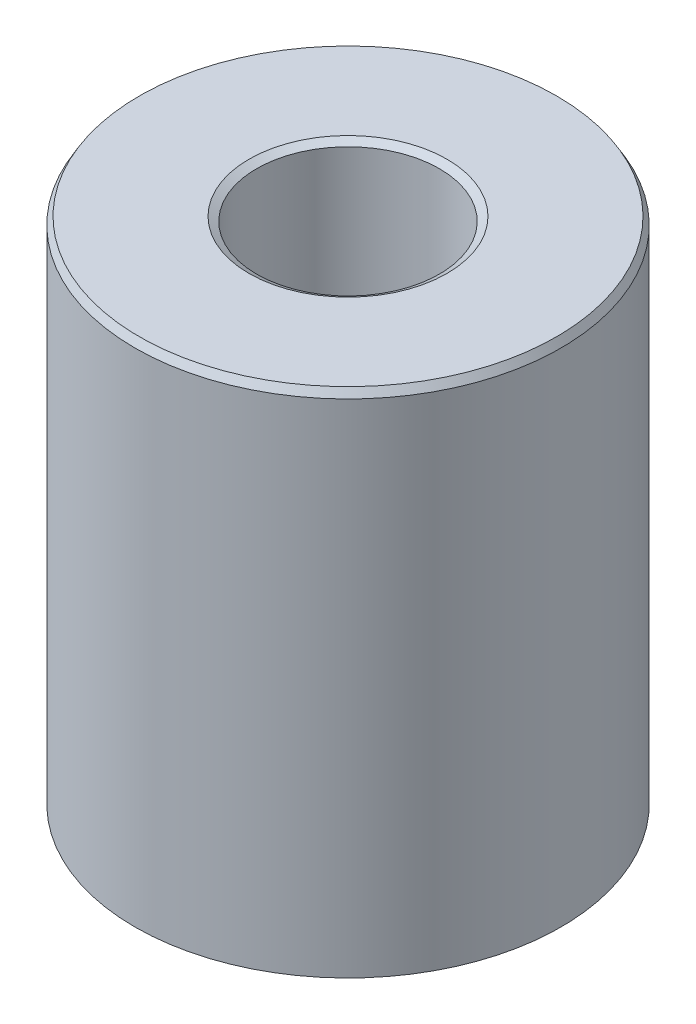
ISO-10303-21;
HEADER;
FILE_DESCRIPTION(('STEP AP214'),'2;1');
FILE_NAME('part.step','',(''),(''),'','','');
FILE_SCHEMA(('AUTOMOTIVE_DESIGN { 1 0 10303 214 1 1 1 1 }'));
ENDSEC;
DATA;
#1=APPLICATION_CONTEXT('core data for automotive mechanical design processes');
#2=APPLICATION_PROTOCOL_DEFINITION('international standard','automotive_design',2000,#1);
#3=PRODUCT_CONTEXT('',#1,'mechanical');
#4=PRODUCT('Part','Part','',(#3));
#5=PRODUCT_RELATED_PRODUCT_CATEGORY('part','',(#4));
#6=PRODUCT_DEFINITION_FORMATION('','',#4);
#7=PRODUCT_DEFINITION_CONTEXT('part definition',#1,'design');
#8=PRODUCT_DEFINITION('design','',#6,#7);
#9=PRODUCT_DEFINITION_SHAPE('','',#8);
#10=(LENGTH_UNIT() NAMED_UNIT(*) SI_UNIT(.MILLI.,.METRE.));
#11=(NAMED_UNIT(*) PLANE_ANGLE_UNIT() SI_UNIT($,.RADIAN.));
#12=(NAMED_UNIT(*) SI_UNIT($,.STERADIAN.) SOLID_ANGLE_UNIT());
#13=UNCERTAINTY_MEASURE_WITH_UNIT(LENGTH_MEASURE(1.E-05),#10,'distance_accuracy_value','');
#14=(GEOMETRIC_REPRESENTATION_CONTEXT(3) GLOBAL_UNCERTAINTY_ASSIGNED_CONTEXT((#13)) GLOBAL_UNIT_ASSIGNED_CONTEXT((#10,
#11,#12)) REPRESENTATION_CONTEXT('',''));
#15=CARTESIAN_POINT('',(0.,0.,0.));
#16=DIRECTION('',(0.,0.,1.));
#17=DIRECTION('',(1.,0.,0.));
#18=AXIS2_PLACEMENT_3D('',#15,#16,#17);
#19=CARTESIAN_POINT('',(0.,84.3690094837138,0.));
#20=DIRECTION('',(0.,-1.,0.));
#21=DIRECTION('',(0.,0.,-1.));
#22=AXIS2_PLACEMENT_3D('',#19,#20,#21);
#23=CYLINDRICAL_SURFACE('',#22,35.);
#24=CARTESIAN_POINT('',(0.,0.720286490076341,0.));
#25=DIRECTION('',(0.,1.,0.));
#26=DIRECTION('',(0.,0.,1.));
#27=AXIS2_PLACEMENT_3D('',#24,#25,#26);
#28=CIRCLE('',#27,35.);
#29=CARTESIAN_POINT('',(0.,0.720286490076327,-35.));
#30=VERTEX_POINT('',#29);
#31=EDGE_CURVE('E10',#30,#30,#28,.T.);
#32=CARTESIAN_POINT('',(0.,83.1214366868963,0.));
#33=DIRECTION('',(0.,1.,0.));
#34=DIRECTION('',(0.,0.,1.));
#35=AXIS2_PLACEMENT_3D('',#32,#33,#34);
#36=CIRCLE('',#35,35.);
#37=CARTESIAN_POINT('',(0.,83.1214366868962,-35.));
#38=VERTEX_POINT('',#37);
#39=EDGE_CURVE('E50',#38,#38,#36,.F.);
#40=CARTESIAN_POINT('',(0.,0.720286490076327,-35.));
#41=CARTESIAN_POINT('',(0.,1.57863180462653,-35.));
#42=CARTESIAN_POINT('',(0.,2.43697711917674,-35.));
#43=CARTESIAN_POINT('',(0.,4.15366774827715,-35.));
#44=CARTESIAN_POINT('',(0.,5.01201306282736,-35.));
#45=CARTESIAN_POINT('',(0.,6.72870369192778,-35.));
#46=CARTESIAN_POINT('',(0.,7.58704900647799,-35.));
#47=CARTESIAN_POINT('',(0.,9.30373963557841,-35.));
#48=CARTESIAN_POINT('',(0.,10.1620849501286,-35.));
#49=CARTESIAN_POINT('',(0.,11.878775579229,-35.));
#50=CARTESIAN_POINT('',(0.,12.7371208937792,-35.));
#51=CARTESIAN_POINT('',(0.,14.4538115228796,-35.));
#52=CARTESIAN_POINT('',(0.,15.3121568374299,-35.));
#53=CARTESIAN_POINT('',(0.,17.0288474665303,-35.));
#54=CARTESIAN_POINT('',(0.,17.8871927810805,-35.));
#55=CARTESIAN_POINT('',(0.,19.6038834101809,-35.));
#56=CARTESIAN_POINT('',(0.,20.4622287247311,-35.));
#57=CARTESIAN_POINT('',(0.,22.1789193538315,-35.));
#58=CARTESIAN_POINT('',(0.,23.0372646683817,-35.));
#59=CARTESIAN_POINT('',(0.,24.7539552974821,-35.));
#60=CARTESIAN_POINT('',(0.,25.6123006120323,-35.));
#61=CARTESIAN_POINT('',(0.,27.3289912411328,-35.));
#62=CARTESIAN_POINT('',(0.,28.187336555683,-35.));
#63=CARTESIAN_POINT('',(0.,29.9040271847834,-35.));
#64=CARTESIAN_POINT('',(0.,30.7623724993336,-35.));
#65=CARTESIAN_POINT('',(0.,32.479063128434,-35.));
#66=CARTESIAN_POINT('',(0.,33.3374084429842,-35.));
#67=CARTESIAN_POINT('',(0.,35.0540990720846,-35.));
#68=CARTESIAN_POINT('',(0.,35.9124443866348,-35.));
#69=CARTESIAN_POINT('',(0.,37.6291350157352,-35.));
#70=CARTESIAN_POINT('',(0.,38.4874803302855,-35.));
#71=CARTESIAN_POINT('',(0.,40.2041709593859,-35.));
#72=CARTESIAN_POINT('',(0.,41.0625162739361,-35.));
#73=CARTESIAN_POINT('',(0.,42.7792069030365,-35.));
#74=CARTESIAN_POINT('',(0.,43.6375522175867,-35.));
#75=CARTESIAN_POINT('',(0.,45.3542428466871,-35.));
#76=CARTESIAN_POINT('',(0.,46.2125881612373,-35.));
#77=CARTESIAN_POINT('',(0.,47.9292787903377,-35.));
#78=CARTESIAN_POINT('',(0.,48.7876241048879,-35.));
#79=CARTESIAN_POINT('',(0.,50.5043147339884,-35.));
#80=CARTESIAN_POINT('',(0.,51.3626600485386,-35.));
#81=CARTESIAN_POINT('',(0.,53.079350677639,-35.));
#82=CARTESIAN_POINT('',(0.,53.9376959921892,-35.));
#83=CARTESIAN_POINT('',(0.,55.6543866212896,-35.));
#84=CARTESIAN_POINT('',(0.,56.5127319358398,-35.));
#85=CARTESIAN_POINT('',(0.,58.2294225649402,-35.));
#86=CARTESIAN_POINT('',(0.,59.0877678794904,-35.));
#87=CARTESIAN_POINT('',(0.,60.8044585085908,-35.));
#88=CARTESIAN_POINT('',(0.,61.662803823141,-35.));
#89=CARTESIAN_POINT('',(0.,63.3794944522415,-35.));
#90=CARTESIAN_POINT('',(0.,64.2378397667917,-35.));
#91=CARTESIAN_POINT('',(0.,65.9545303958921,-35.));
#92=CARTESIAN_POINT('',(0.,66.8128757104423,-35.));
#93=CARTESIAN_POINT('',(0.,68.5295663395427,-35.));
#94=CARTESIAN_POINT('',(0.,69.3879116540929,-35.));
#95=CARTESIAN_POINT('',(0.,71.1046022831933,-35.));
#96=CARTESIAN_POINT('',(0.,71.9629475977436,-35.));
#97=CARTESIAN_POINT('',(0.,73.6796382268439,-35.));
#98=CARTESIAN_POINT('',(0.,74.5379835413942,-35.));
#99=CARTESIAN_POINT('',(0.,76.2546741704946,-35.));
#100=CARTESIAN_POINT('',(0.,77.1130194850448,-35.));
#101=CARTESIAN_POINT('',(0.,78.8297101141452,-35.));
#102=CARTESIAN_POINT('',(0.,79.6880554286954,-35.));
#103=CARTESIAN_POINT('',(0.,81.4047460577958,-35.));
#104=CARTESIAN_POINT('',(0.,82.263091372346,-35.));
#105=CARTESIAN_POINT('',(0.,83.1214366868962,-35.));
#106=B_SPLINE_CURVE_WITH_KNOTS('',3,(#40,#41,#42,#43,#44,#45,#46,#47,#48,#49,#50,#51,#52,#53,
#54,#55,#56,#57,#58,#59,#60,#61,#62,#63,#64,#65,#66,#67,#68,#69,#70,#71,#72,#73,#74,#75,#76,#77,
#78,#79,#80,#81,#82,#83,#84,#85,#86,#87,#88,#89,#90,#91,#92,#93,#94,#95,#96,#97,#98,#99,#100,
#101,#102,#103,#104,#105),.UNSPECIFIED.,.F.,.F.,(4,2,2,2,2,2,2,2,2,2,2,2,2,2,2,2,2,2,2,2,2,2,2,
2,2,2,2,2,2,2,2,2,4),(0.,2.57503594365062,5.15007188730124,7.72510783095187,10.3001437746025,
12.8751797182531,15.4502156619037,18.0252516055544,20.600287549205,23.1753234928556,
25.7503594365062,28.3253953801568,30.9004313238075,33.4754672674581,36.0505032111087,
38.6255391547593,41.20057509841,43.7756110420606,46.3506469857112,48.9256829293618,
51.5007188730124,54.0757548166631,56.6507907603137,59.2258267039643,61.8008626476149,
64.3758985912656,66.9509345349162,69.5259704785668,72.1010064222174,74.676042365868,
77.2510783095187,79.8261142531693,82.4011501968199),.UNSPECIFIED.);
#107=EDGE_CURVE('BSEAM39',#30,#38,#106,.T.);
#108=ORIENTED_EDGE('',*,*,#31,.T.);
#109=ORIENTED_EDGE('',*,*,#39,.T.);
#110=ORIENTED_EDGE('',*,*,#107,.T.);
#111=ORIENTED_EDGE('',*,*,#107,.F.);
#112=EDGE_LOOP('',(#108,#110,#109,#111));
#113=FACE_BOUND('',#112,.T.);
#114=ADVANCED_FACE('F39',(#113),#23,.T.);
#115=CARTESIAN_POINT('',(0.,84.3690094837138,0.));
#116=DIRECTION('',(0.,1.,0.));
#117=DIRECTION('',(0.,0.,1.));
#118=AXIS2_PLACEMENT_3D('',#115,#116,#117);
#119=PLANE('',#118);
#120=CARTESIAN_POINT('',(0.,84.3690094837138,0.));
#121=DIRECTION('',(0.,1.,0.));
#122=DIRECTION('',(0.,0.,1.));
#123=AXIS2_PLACEMENT_3D('',#120,#121,#122);
#124=CIRCLE('',#123,16.2672913488029);
#125=CARTESIAN_POINT('',(0.,84.3690094837138,16.2672913488029));
#126=VERTEX_POINT('',#125);
#127=EDGE_CURVE('E58',#126,#126,#124,.F.);
#128=ORIENTED_EDGE('',*,*,#127,.T.);
#129=EDGE_LOOP('',(#128));
#130=FACE_BOUND('',#129,.T.);
#131=CARTESIAN_POINT('',(0.,84.3690094837138,0.));
#132=DIRECTION('',(0.,1.,0.));
#133=DIRECTION('',(0.,0.,1.));
#134=AXIS2_PLACEMENT_3D('',#131,#132,#133);
#135=CIRCLE('',#134,34.2797135099238);
#136=CARTESIAN_POINT('',(0.,84.3690094837138,-34.2797135099238));
#137=VERTEX_POINT('',#136);
#138=EDGE_CURVE('E61',#137,#137,#135,.T.);
#139=ORIENTED_EDGE('',*,*,#138,.T.);
#140=EDGE_LOOP('',(#139));
#141=FACE_BOUND('',#140,.T.);
#142=ADVANCED_FACE('F88',(#130,#141),#119,.T.);
#143=CARTESIAN_POINT('',(0.,0.,0.));
#144=DIRECTION('',(0.,1.,0.));
#145=DIRECTION('',(0.,0.,1.));
#146=AXIS2_PLACEMENT_3D('',#143,#144,#145);
#147=PLANE('',#146);
#148=CARTESIAN_POINT('',(0.,0.,0.));
#149=DIRECTION('',(0.,1.,0.));
#150=DIRECTION('',(0.,0.,1.));
#151=AXIS2_PLACEMENT_3D('',#148,#149,#150);
#152=CIRCLE('',#151,15.7400050420615);
#153=CARTESIAN_POINT('',(0.,0.,15.7400050420615));
#154=VERTEX_POINT('',#153);
#155=EDGE_CURVE('E51',#154,#154,#152,.T.);
#156=ORIENTED_EDGE('',*,*,#155,.T.);
#157=EDGE_LOOP('',(#156));
#158=FACE_BOUND('',#157,.T.);
#159=CARTESIAN_POINT('',(0.,0.,0.));
#160=DIRECTION('',(0.,1.,0.));
#161=DIRECTION('',(0.,0.,1.));
#162=AXIS2_PLACEMENT_3D('',#159,#160,#161);
#163=CIRCLE('',#162,33.7524272031823);
#164=CARTESIAN_POINT('',(0.,0.,33.7524272031823));
#165=VERTEX_POINT('',#164);
#166=EDGE_CURVE('E54',#165,#165,#163,.F.);
#167=ORIENTED_EDGE('',*,*,#166,.T.);
#168=EDGE_LOOP('',(#167));
#169=FACE_BOUND('',#168,.T.);
#170=ADVANCED_FACE('F83',(#158,#169),#147,.F.);
#171=CARTESIAN_POINT('',(0.,84.3690094837138,0.));
#172=DIRECTION('',(0.,-1.,0.));
#173=DIRECTION('',(0.,0.,-1.));
#174=AXIS2_PLACEMENT_3D('',#171,#172,#173);
#175=CYLINDRICAL_SURFACE('',#174,15.0197185519853);
#176=CARTESIAN_POINT('',(0.,83.6487229936375,0.));
#177=DIRECTION('',(0.,1.,0.));
#178=DIRECTION('',(0.,0.,1.));
#179=AXIS2_PLACEMENT_3D('',#176,#177,#178);
#180=CIRCLE('',#179,15.0197185519853);
#181=CARTESIAN_POINT('',(0.,83.6487229936375,-15.0197185519853));
#182=VERTEX_POINT('',#181);
#183=EDGE_CURVE('E67',#182,#182,#180,.T.);
#184=CARTESIAN_POINT('',(0.,1.24757279681759,0.));
#185=DIRECTION('',(0.,1.,0.));
#186=DIRECTION('',(0.,0.,1.));
#187=AXIS2_PLACEMENT_3D('',#184,#185,#186);
#188=CIRCLE('',#187,15.0197185519853);
#189=CARTESIAN_POINT('',(0.,1.24757279681759,-15.0197185519853));
#190=VERTEX_POINT('',#189);
#191=EDGE_CURVE('E69',#190,#190,#188,.F.);
#192=CARTESIAN_POINT('',(0.,83.6487229936375,-15.0197185519853));
#193=CARTESIAN_POINT('',(0.,82.7903776790873,-15.0197185519853));
#194=CARTESIAN_POINT('',(0.,81.9320323645371,-15.0197185519853));
#195=CARTESIAN_POINT('',(0.,80.2153417354366,-15.0197185519853));
#196=CARTESIAN_POINT('',(0.,79.3569964208864,-15.0197185519853));
#197=CARTESIAN_POINT('',(0.,77.640305791786,-15.0197185519853));
#198=CARTESIAN_POINT('',(0.,76.7819604772358,-15.0197185519853));
#199=CARTESIAN_POINT('',(0.,75.0652698481354,-15.0197185519853));
#200=CARTESIAN_POINT('',(0.,74.2069245335852,-15.0197185519853));
#201=CARTESIAN_POINT('',(0.,72.4902339044848,-15.0197185519853));
#202=CARTESIAN_POINT('',(0.,71.6318885899346,-15.0197185519853));
#203=CARTESIAN_POINT('',(0.,69.9151979608342,-15.0197185519853));
#204=CARTESIAN_POINT('',(0.,69.0568526462839,-15.0197185519853));
#205=CARTESIAN_POINT('',(0.,67.3401620171835,-15.0197185519853));
#206=CARTESIAN_POINT('',(0.,66.4818167026333,-15.0197185519853));
#207=CARTESIAN_POINT('',(0.,64.7651260735329,-15.0197185519853));
#208=CARTESIAN_POINT('',(0.,63.9067807589827,-15.0197185519853));
#209=CARTESIAN_POINT('',(0.,62.1900901298823,-15.0197185519853));
#210=CARTESIAN_POINT('',(0.,61.3317448153321,-15.0197185519853));
#211=CARTESIAN_POINT('',(0.,59.6150541862317,-15.0197185519853));
#212=CARTESIAN_POINT('',(0.,58.7567088716815,-15.0197185519853));
#213=CARTESIAN_POINT('',(0.,57.040018242581,-15.0197185519853));
#214=CARTESIAN_POINT('',(0.,56.1816729280308,-15.0197185519853));
#215=CARTESIAN_POINT('',(0.,54.4649822989304,-15.0197185519853));
#216=CARTESIAN_POINT('',(0.,53.6066369843802,-15.0197185519853));
#217=CARTESIAN_POINT('',(0.,51.8899463552798,-15.0197185519853));
#218=CARTESIAN_POINT('',(0.,51.0316010407296,-15.0197185519853));
#219=CARTESIAN_POINT('',(0.,49.3149104116292,-15.0197185519853));
#220=CARTESIAN_POINT('',(0.,48.456565097079,-15.0197185519853));
#221=CARTESIAN_POINT('',(0.,46.7398744679786,-15.0197185519853));
#222=CARTESIAN_POINT('',(0.,45.8815291534284,-15.0197185519853));
#223=CARTESIAN_POINT('',(0.,44.1648385243279,-15.0197185519853));
#224=CARTESIAN_POINT('',(0.,43.3064932097777,-15.0197185519853));
#225=CARTESIAN_POINT('',(0.,41.5898025806773,-15.0197185519853));
#226=CARTESIAN_POINT('',(0.,40.7314572661271,-15.0197185519853));
#227=CARTESIAN_POINT('',(0.,39.0147666370267,-15.0197185519853));
#228=CARTESIAN_POINT('',(0.,38.1564213224765,-15.0197185519853));
#229=CARTESIAN_POINT('',(0.,36.4397306933761,-15.0197185519853));
#230=CARTESIAN_POINT('',(0.,35.5813853788259,-15.0197185519853));
#231=CARTESIAN_POINT('',(0.,33.8646947497255,-15.0197185519853));
#232=CARTESIAN_POINT('',(0.,33.0063494351752,-15.0197185519853));
#233=CARTESIAN_POINT('',(0.,31.2896588060748,-15.0197185519853));
#234=CARTESIAN_POINT('',(0.,30.4313134915246,-15.0197185519853));
#235=CARTESIAN_POINT('',(0.,28.7146228624242,-15.0197185519853));
#236=CARTESIAN_POINT('',(0.,27.856277547874,-15.0197185519853));
#237=CARTESIAN_POINT('',(0.,26.1395869187736,-15.0197185519853));
#238=CARTESIAN_POINT('',(0.,25.2812416042234,-15.0197185519853));
#239=CARTESIAN_POINT('',(0.,23.564550975123,-15.0197185519853));
#240=CARTESIAN_POINT('',(0.,22.7062056605728,-15.0197185519853));
#241=CARTESIAN_POINT('',(0.,20.9895150314724,-15.0197185519853));
#242=CARTESIAN_POINT('',(0.,20.1311697169221,-15.0197185519853));
#243=CARTESIAN_POINT('',(0.,18.4144790878217,-15.0197185519853));
#244=CARTESIAN_POINT('',(0.,17.5561337732715,-15.0197185519853));
#245=CARTESIAN_POINT('',(0.,15.8394431441711,-15.0197185519853));
#246=CARTESIAN_POINT('',(0.,14.9810978296209,-15.0197185519853));
#247=CARTESIAN_POINT('',(0.,13.2644072005205,-15.0197185519853));
#248=CARTESIAN_POINT('',(0.,12.4060618859703,-15.0197185519853));
#249=CARTESIAN_POINT('',(0.,10.6893712568699,-15.0197185519853));
#250=CARTESIAN_POINT('',(0.,9.83102594231966,-15.0197185519853));
#251=CARTESIAN_POINT('',(0.,8.11433531321925,-15.0197185519853));
#252=CARTESIAN_POINT('',(0.,7.25598999866904,-15.0197185519853));
#253=CARTESIAN_POINT('',(0.,5.53929936956861,-15.0197185519853));
#254=CARTESIAN_POINT('',(0.,4.6809540550184,-15.0197185519853));
#255=CARTESIAN_POINT('',(0.,2.96426342591799,-15.0197185519853));
#256=CARTESIAN_POINT('',(0.,2.10591811136779,-15.0197185519853));
#257=CARTESIAN_POINT('',(0.,1.24757279681759,-15.0197185519853));
#258=B_SPLINE_CURVE_WITH_KNOTS('',3,(#192,#193,#194,#195,#196,#197,#198,#199,#200,#201,#202,
#203,#204,#205,#206,#207,#208,#209,#210,#211,#212,#213,#214,#215,#216,#217,#218,#219,#220,#221,
#222,#223,#224,#225,#226,#227,#228,#229,#230,#231,#232,#233,#234,#235,#236,#237,#238,#239,#240,
#241,#242,#243,#244,#245,#246,#247,#248,#249,#250,#251,#252,#253,#254,#255,#256,#257),
.UNSPECIFIED.,.F.,.F.,(4,2,2,2,2,2,2,2,2,2,2,2,2,2,2,2,2,2,2,2,2,2,2,2,2,2,2,2,2,2,2,2,4),(0.,
2.57503594365063,5.15007188730125,7.72510783095187,10.3001437746025,12.8751797182531,
15.4502156619037,18.0252516055544,20.600287549205,23.1753234928556,25.7503594365062,
28.3253953801568,30.9004313238075,33.4754672674581,36.0505032111087,38.6255391547593,
41.2005750984099,43.7756110420606,46.3506469857112,48.9256829293618,51.5007188730124,
54.0757548166631,56.6507907603137,59.2258267039643,61.8008626476149,64.3758985912655,
66.9509345349162,69.5259704785668,72.1010064222174,74.676042365868,77.2510783095186,
79.8261142531693,82.4011501968199),.UNSPECIFIED.);
#259=EDGE_CURVE('BSEAM71',#182,#190,#258,.T.);
#260=ORIENTED_EDGE('',*,*,#183,.T.);
#261=ORIENTED_EDGE('',*,*,#191,.T.);
#262=ORIENTED_EDGE('',*,*,#259,.T.);
#263=ORIENTED_EDGE('',*,*,#259,.F.);
#264=EDGE_LOOP('',(#260,#262,#261,#263));
#265=FACE_BOUND('',#264,.T.);
#266=ADVANCED_FACE('F71',(#265),#175,.F.);
#267=CARTESIAN_POINT('',(0.,83.6487229936375,0.));
#268=DIRECTION('',(0.,1.,0.));
#269=DIRECTION('',(0.,0.,1.));
#270=AXIS2_PLACEMENT_3D('',#267,#268,#269);
#271=CONICAL_SURFACE('',#270,15.0197185519853,1.0471975511966);
#272=ORIENTED_EDGE('',*,*,#127,.F.);
#273=EDGE_LOOP('',(#272));
#274=FACE_BOUND('',#273,.T.);
#275=ORIENTED_EDGE('',*,*,#183,.F.);
#276=EDGE_LOOP('',(#275));
#277=FACE_BOUND('',#276,.T.);
#278=ADVANCED_FACE('F77',(#274,#277),#271,.F.);
#279=CARTESIAN_POINT('',(0.,0.,0.));
#280=DIRECTION('',(0.,-1.,0.));
#281=DIRECTION('',(0.,0.,-1.));
#282=AXIS2_PLACEMENT_3D('',#279,#280,#281);
#283=CONICAL_SURFACE('',#282,15.7400050420615,0.523598775598295);
#284=ORIENTED_EDGE('',*,*,#191,.F.);
#285=EDGE_LOOP('',(#284));
#286=FACE_BOUND('',#285,.T.);
#287=ORIENTED_EDGE('',*,*,#155,.F.);
#288=EDGE_LOOP('',(#287));
#289=FACE_BOUND('',#288,.T.);
#290=ADVANCED_FACE('F73',(#286,#289),#283,.F.);
#291=CARTESIAN_POINT('',(0.,0.720286490076341,0.));
#292=DIRECTION('',(0.,1.,0.));
#293=DIRECTION('',(0.,0.,1.));
#294=AXIS2_PLACEMENT_3D('',#291,#292,#293);
#295=CONICAL_SURFACE('',#294,35.,1.0471975511966);
#296=ORIENTED_EDGE('',*,*,#166,.F.);
#297=EDGE_LOOP('',(#296));
#298=FACE_BOUND('',#297,.T.);
#299=ORIENTED_EDGE('',*,*,#31,.F.);
#300=EDGE_LOOP('',(#299));
#301=FACE_BOUND('',#300,.T.);
#302=ADVANCED_FACE('F76',(#298,#301),#295,.T.);
#303=CARTESIAN_POINT('',(0.,84.3690094837138,0.));
#304=DIRECTION('',(0.,-1.,0.));
#305=DIRECTION('',(0.,0.,-1.));
#306=AXIS2_PLACEMENT_3D('',#303,#304,#305);
#307=CONICAL_SURFACE('',#306,34.2797135099238,0.523598775598291);
#308=CARTESIAN_POINT('',(0.,83.1214366868962,-35.));
#309=CARTESIAN_POINT('',(0.,83.1344322368631,-34.9924970157284));
#310=CARTESIAN_POINT('',(0.,83.14742778683,-34.9849940314568));
#311=CARTESIAN_POINT('',(0.,83.1734188867636,-34.9699880629135));
#312=CARTESIAN_POINT('',(0.,83.1864144367305,-34.9624850786419));
#313=CARTESIAN_POINT('',(0.,83.2124055366642,-34.9474791100986));
#314=CARTESIAN_POINT('',(0.,83.225401086631,-34.939976125827));
#315=CARTESIAN_POINT('',(0.,83.2513921865647,-34.9249701572837));
#316=CARTESIAN_POINT('',(0.,83.2643877365316,-34.9174671730121));
#317=CARTESIAN_POINT('',(0.,83.2903788364653,-34.9024612044689));
#318=CARTESIAN_POINT('',(0.,83.3033743864321,-34.8949582201972));
#319=CARTESIAN_POINT('',(0.,83.3293654863658,-34.879952251654));
#320=CARTESIAN_POINT('',(0.,83.3423610363327,-34.8724492673823));
#321=CARTESIAN_POINT('',(0.,83.3683521362664,-34.8574432988391));
#322=CARTESIAN_POINT('',(0.,83.3813476862332,-34.8499403145675));
#323=CARTESIAN_POINT('',(0.,83.4073387861669,-34.8349343460242));
#324=CARTESIAN_POINT('',(0.,83.4203343361338,-34.8274313617526));
#325=CARTESIAN_POINT('',(0.,83.4463254360675,-34.8124253932093));
#326=CARTESIAN_POINT('',(0.,83.4593209860343,-34.8049224089377));
#327=CARTESIAN_POINT('',(0.,83.485312085968,-34.7899164403944));
#328=CARTESIAN_POINT('',(0.,83.4983076359349,-34.7824134561228));
#329=CARTESIAN_POINT('',(0.,83.5242987358686,-34.7674074875796));
#330=CARTESIAN_POINT('',(0.,83.5372942858354,-34.7599045033079));
#331=CARTESIAN_POINT('',(0.,83.5632853857691,-34.7448985347647));
#332=CARTESIAN_POINT('',(0.,83.576280935736,-34.737395550493));
#333=CARTESIAN_POINT('',(0.,83.6022720356697,-34.7223895819498));
#334=CARTESIAN_POINT('',(0.,83.6152675856365,-34.7148865976782));
#335=CARTESIAN_POINT('',(0.,83.6412586855702,-34.6998806291349));
#336=CARTESIAN_POINT('',(0.,83.6542542355371,-34.6923776448633));
#337=CARTESIAN_POINT('',(0.,83.6802453354708,-34.67737167632));
#338=CARTESIAN_POINT('',(0.,83.6932408854376,-34.6698686920484));
#339=CARTESIAN_POINT('',(0.,83.7192319853713,-34.6548627235051));
#340=CARTESIAN_POINT('',(0.,83.7322275353382,-34.6473597392335));
#341=CARTESIAN_POINT('',(0.,83.7582186352719,-34.6323537706903));
#342=CARTESIAN_POINT('',(0.,83.7712141852387,-34.6248507864186));
#343=CARTESIAN_POINT('',(0.,83.7972052851724,-34.6098448178754));
#344=CARTESIAN_POINT('',(0.,83.8102008351393,-34.6023418336038));
#345=CARTESIAN_POINT('',(0.,83.836191935073,-34.5873358650605));
#346=CARTESIAN_POINT('',(0.,83.8491874850398,-34.5798328807889));
#347=CARTESIAN_POINT('',(0.,83.8751785849735,-34.5648269122456));
#348=CARTESIAN_POINT('',(0.,83.8881741349404,-34.557323927974));
#349=CARTESIAN_POINT('',(0.,83.9141652348741,-34.5423179594307));
#350=CARTESIAN_POINT('',(0.,83.9271607848409,-34.5348149751591));
#351=CARTESIAN_POINT('',(0.,83.9531518847746,-34.5198090066159));
#352=CARTESIAN_POINT('',(0.,83.9661474347415,-34.5123060223442));
#353=CARTESIAN_POINT('',(0.,83.9921385346752,-34.497300053801));
#354=CARTESIAN_POINT('',(0.,84.005134084642,-34.4897970695293));
#355=CARTESIAN_POINT('',(0.,84.0311251845757,-34.4747911009861));
#356=CARTESIAN_POINT('',(0.,84.0441207345425,-34.4672881167145));
#357=CARTESIAN_POINT('',(0.,84.0701118344763,-34.4522821481712));
#358=CARTESIAN_POINT('',(0.,84.0831073844431,-34.4447791638996));
#359=CARTESIAN_POINT('',(0.,84.1090984843768,-34.4297731953563));
#360=CARTESIAN_POINT('',(0.,84.1220940343436,-34.4222702110847));
#361=CARTESIAN_POINT('',(0.,84.1480851342774,-34.4072642425414));
#362=CARTESIAN_POINT('',(0.,84.1610806842442,-34.3997612582698));
#363=CARTESIAN_POINT('',(0.,84.1870717841779,-34.3847552897265));
#364=CARTESIAN_POINT('',(0.,84.2000673341447,-34.3772523054549));
#365=CARTESIAN_POINT('',(0.,84.2260584340785,-34.3622463369117));
#366=CARTESIAN_POINT('',(0.,84.2390539840453,-34.35474335264));
#367=CARTESIAN_POINT('',(0.,84.265045083979,-34.3397373840968));
#368=CARTESIAN_POINT('',(0.,84.2780406339458,-34.3322343998252));
#369=CARTESIAN_POINT('',(0.,84.3040317338795,-34.3172284312819));
#370=CARTESIAN_POINT('',(0.,84.3170272838464,-34.3097254470103));
#371=CARTESIAN_POINT('',(0.,84.3430183837801,-34.294719478467));
#372=CARTESIAN_POINT('',(0.,84.356013933747,-34.2872164941954));
#373=CARTESIAN_POINT('',(0.,84.3690094837138,-34.2797135099238));
#374=B_SPLINE_CURVE_WITH_KNOTS('',3,(#308,#309,#310,#311,#312,#313,#314,#315,#316,#317,#318,
#319,#320,#321,#322,#323,#324,#325,#326,#327,#328,#329,#330,#331,#332,#333,#334,#335,#336,#337,
#338,#339,#340,#341,#342,#343,#344,#345,#346,#347,#348,#349,#350,#351,#352,#353,#354,#355,#356,
#357,#358,#359,#360,#361,#362,#363,#364,#365,#366,#367,#368,#369,#370,#371,#372,#373),
.UNSPECIFIED.,.F.,.F.,(4,2,2,2,2,2,2,2,2,2,2,2,2,2,2,2,2,2,2,2,2,2,2,2,2,2,2,2,2,2,2,2,4),(0.,
0.045017905629774,0.0900358112595445,0.135053716889306,0.180071622519077,0.225089528148835,
0.270107433778609,0.315125339408368,0.360143245038142,0.4051611506679,0.450179056297671,
0.495196961927433,0.540214867557203,0.585232773186965,0.630250678816736,0.675268584446498,
0.720286490076268,0.765304395706039,0.810322301335801,0.855340206965571,0.900358112595333,
0.945376018225104,0.990393923854862,1.03541182948464,1.08042973511439,1.12544764074417,
1.17046554637393,1.2154834520037,1.26050135763346,1.30551926326323,1.35053716889299,
1.39555507452276,1.44057298015253),.UNSPECIFIED.);
#375=EDGE_CURVE('BSEAM45',#38,#137,#374,.T.);
#376=ORIENTED_EDGE('',*,*,#39,.F.);
#377=ORIENTED_EDGE('',*,*,#138,.F.);
#378=ORIENTED_EDGE('',*,*,#375,.T.);
#379=ORIENTED_EDGE('',*,*,#375,.F.);
#380=EDGE_LOOP('',(#376,#378,#377,#379));
#381=FACE_BOUND('',#380,.T.);
#382=ADVANCED_FACE('F45',(#381),#307,.T.);
#383=CLOSED_SHELL('',(#114,#142,#170,#266,#278,#290,#302,#382));
#384=MANIFOLD_SOLID_BREP('B2',#383);
#385=ADVANCED_BREP_SHAPE_REPRESENTATION('',(#18,#384),#14);
#386=SHAPE_DEFINITION_REPRESENTATION(#9,#385);
ENDSEC;
END-ISO-10303-21;
